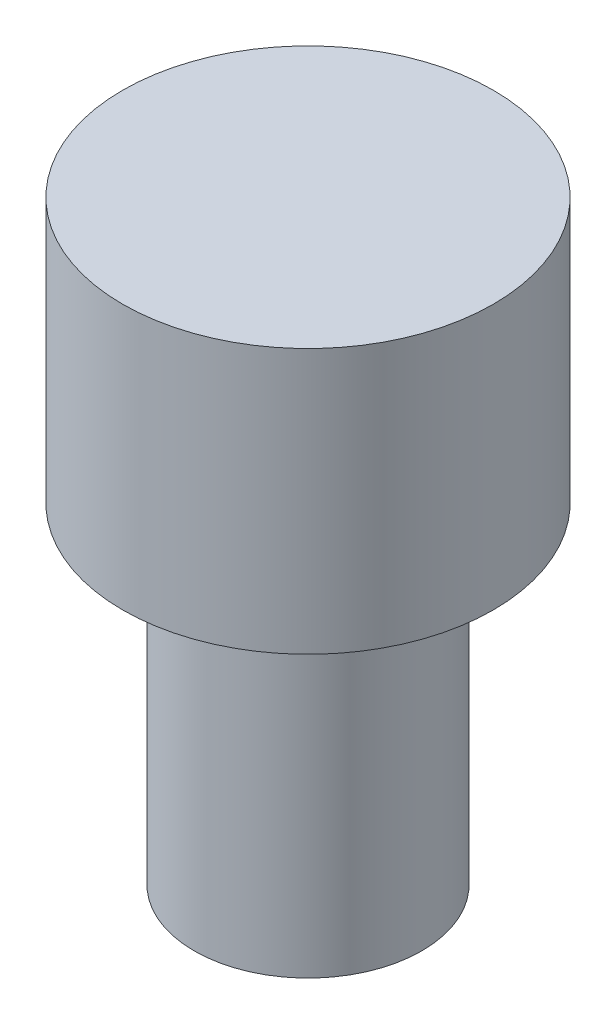
ISO-10303-21;
HEADER;
FILE_DESCRIPTION(('STEP AP214'),'2;1');
FILE_NAME('part.step','',(''),(''),'','','');
FILE_SCHEMA(('AUTOMOTIVE_DESIGN { 1 0 10303 214 1 1 1 1 }'));
ENDSEC;
DATA;
#1=APPLICATION_CONTEXT('core data for automotive mechanical design processes');
#2=APPLICATION_PROTOCOL_DEFINITION('international standard','automotive_design',2000,#1);
#3=PRODUCT_CONTEXT('',#1,'mechanical');
#4=PRODUCT('Part','Part','',(#3));
#5=PRODUCT_RELATED_PRODUCT_CATEGORY('part','',(#4));
#6=PRODUCT_DEFINITION_FORMATION('','',#4);
#7=PRODUCT_DEFINITION_CONTEXT('part definition',#1,'design');
#8=PRODUCT_DEFINITION('design','',#6,#7);
#9=PRODUCT_DEFINITION_SHAPE('','',#8);
#10=(LENGTH_UNIT() NAMED_UNIT(*) SI_UNIT(.MILLI.,.METRE.));
#11=(NAMED_UNIT(*) PLANE_ANGLE_UNIT() SI_UNIT($,.RADIAN.));
#12=(NAMED_UNIT(*) SI_UNIT($,.STERADIAN.) SOLID_ANGLE_UNIT());
#13=UNCERTAINTY_MEASURE_WITH_UNIT(LENGTH_MEASURE(1.E-05),#10,'distance_accuracy_value','');
#14=(GEOMETRIC_REPRESENTATION_CONTEXT(3) GLOBAL_UNCERTAINTY_ASSIGNED_CONTEXT((#13)) GLOBAL_UNIT_ASSIGNED_CONTEXT((#10,
#11,#12)) REPRESENTATION_CONTEXT('',''));
#15=CARTESIAN_POINT('',(0.,0.,0.));
#16=DIRECTION('',(0.,0.,1.));
#17=DIRECTION('',(1.,0.,0.));
#18=AXIS2_PLACEMENT_3D('',#15,#16,#17);
#19=CARTESIAN_POINT('',(0.,2.54,-1.778));
#20=DIRECTION('',(0.,1.,0.));
#21=DIRECTION('',(0.,0.,1.));
#22=AXIS2_PLACEMENT_3D('',#19,#20,#21);
#23=PLANE('',#22);
#24=CARTESIAN_POINT('',(0.,2.54,0.));
#25=DIRECTION('',(0.,-1.,0.));
#26=DIRECTION('',(0.,0.,-1.));
#27=AXIS2_PLACEMENT_3D('',#24,#25,#26);
#28=CIRCLE('',#27,1.778);
#29=CARTESIAN_POINT('',(0.,2.54,-1.778));
#30=VERTEX_POINT('',#29);
#31=EDGE_CURVE('E45',#30,#30,#28,.T.);
#32=ORIENTED_EDGE('',*,*,#31,.F.);
#33=EDGE_LOOP('',(#32));
#34=FACE_BOUND('',#33,.T.);
#35=ADVANCED_FACE('F31',(#34),#23,.T.);
#36=CARTESIAN_POINT('',(0.,-3.175,0.));
#37=DIRECTION('',(0.,-1.,0.));
#38=DIRECTION('',(0.,0.,-1.));
#39=AXIS2_PLACEMENT_3D('',#36,#37,#38);
#40=PLANE('',#39);
#41=CARTESIAN_POINT('',(0.,-3.175,0.));
#42=DIRECTION('',(0.,-1.,0.));
#43=DIRECTION('',(0.,0.,-1.));
#44=AXIS2_PLACEMENT_3D('',#41,#42,#43);
#45=CIRCLE('',#44,1.0922);
#46=CARTESIAN_POINT('',(0.,-3.175,-1.0922));
#47=VERTEX_POINT('',#46);
#48=EDGE_CURVE('E10',#47,#47,#45,.T.);
#49=ORIENTED_EDGE('',*,*,#48,.T.);
#50=EDGE_LOOP('',(#49));
#51=FACE_BOUND('',#50,.T.);
#52=ADVANCED_FACE('F55',(#51),#40,.T.);
#53=CARTESIAN_POINT('',(0.,-20.451032784219,0.));
#54=DIRECTION('',(0.,-1.,0.));
#55=DIRECTION('',(0.,0.,-1.));
#56=AXIS2_PLACEMENT_3D('',#53,#54,#55);
#57=CYLINDRICAL_SURFACE('',#56,1.0922);
#58=CARTESIAN_POINT('',(0.,0.,0.));
#59=DIRECTION('',(0.,-1.,0.));
#60=DIRECTION('',(0.,0.,-1.));
#61=AXIS2_PLACEMENT_3D('',#58,#59,#60);
#62=CIRCLE('',#61,1.0922);
#63=CARTESIAN_POINT('',(0.,0.,-1.0922));
#64=VERTEX_POINT('',#63);
#65=EDGE_CURVE('E37',#64,#64,#62,.T.);
#66=ORIENTED_EDGE('',*,*,#65,.T.);
#67=EDGE_LOOP('',(#66));
#68=FACE_BOUND('',#67,.T.);
#69=ORIENTED_EDGE('',*,*,#48,.F.);
#70=EDGE_LOOP('',(#69));
#71=FACE_BOUND('',#70,.T.);
#72=ADVANCED_FACE('F59',(#68,#71),#57,.T.);
#73=CARTESIAN_POINT('',(0.,0.,-1.0922));
#74=DIRECTION('',(0.,-1.,0.));
#75=DIRECTION('',(0.,0.,-1.));
#76=AXIS2_PLACEMENT_3D('',#73,#74,#75);
#77=PLANE('',#76);
#78=CARTESIAN_POINT('',(0.,0.,0.));
#79=DIRECTION('',(0.,-1.,0.));
#80=DIRECTION('',(0.,0.,-1.));
#81=AXIS2_PLACEMENT_3D('',#78,#79,#80);
#82=CIRCLE('',#81,1.778);
#83=CARTESIAN_POINT('',(0.,0.,-1.778));
#84=VERTEX_POINT('',#83);
#85=EDGE_CURVE('E41',#84,#84,#82,.T.);
#86=ORIENTED_EDGE('',*,*,#85,.T.);
#87=EDGE_LOOP('',(#86));
#88=FACE_BOUND('',#87,.T.);
#89=ORIENTED_EDGE('',*,*,#65,.F.);
#90=EDGE_LOOP('',(#89));
#91=FACE_BOUND('',#90,.T.);
#92=ADVANCED_FACE('F63',(#88,#91),#77,.T.);
#93=CARTESIAN_POINT('',(0.,-20.451032784219,0.));
#94=DIRECTION('',(0.,-1.,0.));
#95=DIRECTION('',(0.,0.,-1.));
#96=AXIS2_PLACEMENT_3D('',#93,#94,#95);
#97=CYLINDRICAL_SURFACE('',#96,1.778);
#98=ORIENTED_EDGE('',*,*,#31,.T.);
#99=EDGE_LOOP('',(#98));
#100=FACE_BOUND('',#99,.T.);
#101=ORIENTED_EDGE('',*,*,#85,.F.);
#102=EDGE_LOOP('',(#101));
#103=FACE_BOUND('',#102,.T.);
#104=ADVANCED_FACE('F51',(#100,#103),#97,.T.);
#105=CLOSED_SHELL('',(#35,#52,#72,#92,#104));
#106=MANIFOLD_SOLID_BREP('B2',#105);
#107=ADVANCED_BREP_SHAPE_REPRESENTATION('',(#18,#106),#14);
#108=SHAPE_DEFINITION_REPRESENTATION(#9,#107);
ENDSEC;
END-ISO-10303-21;
